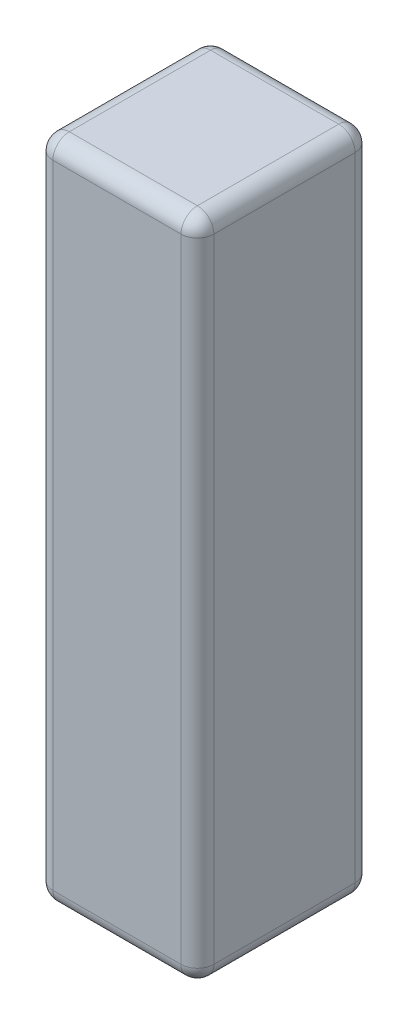
ISO-10303-21;
HEADER;
FILE_DESCRIPTION(('STEP AP214'),'2;1');
FILE_NAME('part.step','',(''),(''),'','','');
FILE_SCHEMA(('AUTOMOTIVE_DESIGN { 1 0 10303 214 1 1 1 1 }'));
ENDSEC;
DATA;
#1=APPLICATION_CONTEXT('core data for automotive mechanical design processes');
#2=APPLICATION_PROTOCOL_DEFINITION('international standard','automotive_design',2000,#1);
#3=PRODUCT_CONTEXT('',#1,'mechanical');
#4=PRODUCT('Part','Part','',(#3));
#5=PRODUCT_RELATED_PRODUCT_CATEGORY('part','',(#4));
#6=PRODUCT_DEFINITION_FORMATION('','',#4);
#7=PRODUCT_DEFINITION_CONTEXT('part definition',#1,'design');
#8=PRODUCT_DEFINITION('design','',#6,#7);
#9=PRODUCT_DEFINITION_SHAPE('','',#8);
#10=(LENGTH_UNIT() NAMED_UNIT(*) SI_UNIT(.MILLI.,.METRE.));
#11=(NAMED_UNIT(*) PLANE_ANGLE_UNIT() SI_UNIT($,.RADIAN.));
#12=(NAMED_UNIT(*) SI_UNIT($,.STERADIAN.) SOLID_ANGLE_UNIT());
#13=UNCERTAINTY_MEASURE_WITH_UNIT(LENGTH_MEASURE(1.E-05),#10,'distance_accuracy_value','');
#14=(GEOMETRIC_REPRESENTATION_CONTEXT(3) GLOBAL_UNCERTAINTY_ASSIGNED_CONTEXT((#13)) GLOBAL_UNIT_ASSIGNED_CONTEXT((#10,
#11,#12)) REPRESENTATION_CONTEXT('',''));
#15=CARTESIAN_POINT('',(0.,0.,0.));
#16=DIRECTION('',(0.,0.,1.));
#17=DIRECTION('',(1.,0.,0.));
#18=AXIS2_PLACEMENT_3D('',#15,#16,#17);
#19=CARTESIAN_POINT('',(-12.446,102.87,-13.462));
#20=DIRECTION('',(1.,0.,0.));
#21=DIRECTION('',(0.,0.,-1.));
#22=AXIS2_PLACEMENT_3D('',#19,#20,#21);
#23=PLANE('',#22);
#24=DIRECTION('',(0.,-1.,0.));
#25=VECTOR('',#24,1.);
#26=CARTESIAN_POINT('',(-12.446,102.87,-10.922));
#27=LINE('',#26,#25);
#28=CARTESIAN_POINT('',(-12.446,100.33,-10.922));
#29=VERTEX_POINT('',#28);
#30=CARTESIAN_POINT('',(-12.446,2.54,-10.922));
#31=VERTEX_POINT('',#30);
#32=EDGE_CURVE('E132',#29,#31,#27,.T.);
#33=ORIENTED_EDGE('',*,*,#32,.T.);
#34=DIRECTION('',(0.,0.,1.));
#35=VECTOR('',#34,1.);
#36=CARTESIAN_POINT('',(-12.446,2.54,13.462));
#37=LINE('',#36,#35);
#38=CARTESIAN_POINT('',(-12.446,2.54,10.922));
#39=VERTEX_POINT('',#38);
#40=EDGE_CURVE('E128',#31,#39,#37,.T.);
#41=ORIENTED_EDGE('',*,*,#40,.T.);
#42=DIRECTION('',(0.,-1.,0.));
#43=VECTOR('',#42,1.);
#44=CARTESIAN_POINT('',(-12.446,102.87,10.922));
#45=LINE('',#44,#43);
#46=CARTESIAN_POINT('',(-12.446,100.33,10.922));
#47=VERTEX_POINT('',#46);
#48=EDGE_CURVE('E121',#39,#47,#45,.F.);
#49=ORIENTED_EDGE('',*,*,#48,.T.);
#50=DIRECTION('',(0.,0.,1.));
#51=VECTOR('',#50,1.);
#52=CARTESIAN_POINT('',(-12.446,100.33,-13.462));
#53=LINE('',#52,#51);
#54=EDGE_CURVE('E125',#47,#29,#53,.F.);
#55=ORIENTED_EDGE('',*,*,#54,.T.);
#56=EDGE_LOOP('',(#33,#41,#49,#55));
#57=FACE_BOUND('',#56,.T.);
#58=ADVANCED_FACE('F33',(#57),#23,.F.);
#59=CARTESIAN_POINT('',(12.446,102.87,13.462));
#60=DIRECTION('',(0.,0.,-1.));
#61=DIRECTION('',(-1.,0.,0.));
#62=AXIS2_PLACEMENT_3D('',#59,#60,#61);
#63=PLANE('',#62);
#64=DIRECTION('',(0.,-1.,0.));
#65=VECTOR('',#64,1.);
#66=CARTESIAN_POINT('',(-9.906,102.87,13.462));
#67=LINE('',#66,#65);
#68=CARTESIAN_POINT('',(-9.906,100.33,13.462));
#69=VERTEX_POINT('',#68);
#70=CARTESIAN_POINT('',(-9.906,2.54,13.462));
#71=VERTEX_POINT('',#70);
#72=EDGE_CURVE('E140',#69,#71,#67,.T.);
#73=ORIENTED_EDGE('',*,*,#72,.T.);
#74=DIRECTION('',(1.,0.,0.));
#75=VECTOR('',#74,1.);
#76=CARTESIAN_POINT('',(12.446,2.54,13.462));
#77=LINE('',#76,#75);
#78=CARTESIAN_POINT('',(9.906,2.54,13.462));
#79=VERTEX_POINT('',#78);
#80=EDGE_CURVE('E187',#71,#79,#77,.T.);
#81=ORIENTED_EDGE('',*,*,#80,.T.);
#82=DIRECTION('',(0.,-1.,0.));
#83=VECTOR('',#82,1.);
#84=CARTESIAN_POINT('',(9.906,102.87,13.462));
#85=LINE('',#84,#83);
#86=CARTESIAN_POINT('',(9.906,100.33,13.462));
#87=VERTEX_POINT('',#86);
#88=EDGE_CURVE('E184',#79,#87,#85,.F.);
#89=ORIENTED_EDGE('',*,*,#88,.T.);
#90=DIRECTION('',(1.,0.,0.));
#91=VECTOR('',#90,1.);
#92=CARTESIAN_POINT('',(12.446,100.33,13.462));
#93=LINE('',#92,#91);
#94=EDGE_CURVE('E182',#87,#69,#93,.F.);
#95=ORIENTED_EDGE('',*,*,#94,.T.);
#96=EDGE_LOOP('',(#73,#81,#89,#95));
#97=FACE_BOUND('',#96,.T.);
#98=ADVANCED_FACE('F293',(#97),#63,.F.);
#99=CARTESIAN_POINT('',(12.446,102.87,-13.462));
#100=DIRECTION('',(-1.,0.,0.));
#101=DIRECTION('',(0.,0.,1.));
#102=AXIS2_PLACEMENT_3D('',#99,#100,#101);
#103=PLANE('',#102);
#104=DIRECTION('',(0.,-1.,0.));
#105=VECTOR('',#104,1.);
#106=CARTESIAN_POINT('',(12.446,102.87,10.922));
#107=LINE('',#106,#105);
#108=CARTESIAN_POINT('',(12.446,100.33,10.922));
#109=VERTEX_POINT('',#108);
#110=CARTESIAN_POINT('',(12.446,2.54,10.922));
#111=VERTEX_POINT('',#110);
#112=EDGE_CURVE('E175',#109,#111,#107,.T.);
#113=ORIENTED_EDGE('',*,*,#112,.T.);
#114=DIRECTION('',(0.,0.,-1.));
#115=VECTOR('',#114,1.);
#116=CARTESIAN_POINT('',(12.446,2.54,-13.462));
#117=LINE('',#116,#115);
#118=CARTESIAN_POINT('',(12.446,2.54,-10.922));
#119=VERTEX_POINT('',#118);
#120=EDGE_CURVE('E180',#111,#119,#117,.T.);
#121=ORIENTED_EDGE('',*,*,#120,.T.);
#122=DIRECTION('',(0.,-1.,0.));
#123=VECTOR('',#122,1.);
#124=CARTESIAN_POINT('',(12.446,102.87,-10.922));
#125=LINE('',#124,#123);
#126=CARTESIAN_POINT('',(12.446,100.33,-10.922));
#127=VERTEX_POINT('',#126);
#128=EDGE_CURVE('E177',#119,#127,#125,.F.);
#129=ORIENTED_EDGE('',*,*,#128,.T.);
#130=DIRECTION('',(0.,0.,-1.));
#131=VECTOR('',#130,1.);
#132=CARTESIAN_POINT('',(12.446,100.33,-13.462));
#133=LINE('',#132,#131);
#134=EDGE_CURVE('E173',#127,#109,#133,.F.);
#135=ORIENTED_EDGE('',*,*,#134,.T.);
#136=EDGE_LOOP('',(#113,#121,#129,#135));
#137=FACE_BOUND('',#136,.T.);
#138=ADVANCED_FACE('F272',(#137),#103,.F.);
#139=CARTESIAN_POINT('',(12.446,102.87,-13.462));
#140=DIRECTION('',(0.,0.,1.));
#141=DIRECTION('',(1.,0.,0.));
#142=AXIS2_PLACEMENT_3D('',#139,#140,#141);
#143=PLANE('',#142);
#144=DIRECTION('',(0.,-1.,0.));
#145=VECTOR('',#144,1.);
#146=CARTESIAN_POINT('',(9.906,102.87,-13.462));
#147=LINE('',#146,#145);
#148=CARTESIAN_POINT('',(9.906,100.33,-13.462));
#149=VERTEX_POINT('',#148);
#150=CARTESIAN_POINT('',(9.906,2.54,-13.462));
#151=VERTEX_POINT('',#150);
#152=EDGE_CURVE('E166',#149,#151,#147,.T.);
#153=ORIENTED_EDGE('',*,*,#152,.T.);
#154=DIRECTION('',(-1.,0.,0.));
#155=VECTOR('',#154,1.);
#156=CARTESIAN_POINT('',(-12.446,2.54,-13.462));
#157=LINE('',#156,#155);
#158=CARTESIAN_POINT('',(-9.906,2.54,-13.462));
#159=VERTEX_POINT('',#158);
#160=EDGE_CURVE('E171',#151,#159,#157,.T.);
#161=ORIENTED_EDGE('',*,*,#160,.T.);
#162=DIRECTION('',(0.,-1.,0.));
#163=VECTOR('',#162,1.);
#164=CARTESIAN_POINT('',(-9.906,102.87,-13.462));
#165=LINE('',#164,#163);
#166=CARTESIAN_POINT('',(-9.906,100.33,-13.462));
#167=VERTEX_POINT('',#166);
#168=EDGE_CURVE('E168',#159,#167,#165,.F.);
#169=ORIENTED_EDGE('',*,*,#168,.T.);
#170=DIRECTION('',(-1.,0.,0.));
#171=VECTOR('',#170,1.);
#172=CARTESIAN_POINT('',(12.446,100.33,-13.462));
#173=LINE('',#172,#171);
#174=EDGE_CURVE('E164',#167,#149,#173,.F.);
#175=ORIENTED_EDGE('',*,*,#174,.T.);
#176=EDGE_LOOP('',(#153,#161,#169,#175));
#177=FACE_BOUND('',#176,.T.);
#178=ADVANCED_FACE('F300',(#177),#143,.F.);
#179=CARTESIAN_POINT('',(0.,102.87,0.));
#180=DIRECTION('',(0.,-1.,0.));
#181=DIRECTION('',(0.,0.,-1.));
#182=AXIS2_PLACEMENT_3D('',#179,#180,#181);
#183=PLANE('',#182);
#184=DIRECTION('',(0.,0.,-1.));
#185=VECTOR('',#184,1.);
#186=CARTESIAN_POINT('',(9.906,102.87,0.));
#187=LINE('',#186,#185);
#188=CARTESIAN_POINT('',(9.906,102.87,10.922));
#189=VERTEX_POINT('',#188);
#190=CARTESIAN_POINT('',(9.906,102.87,-10.922));
#191=VERTEX_POINT('',#190);
#192=EDGE_CURVE('E42',#189,#191,#187,.T.);
#193=ORIENTED_EDGE('',*,*,#192,.T.);
#194=DIRECTION('',(-1.,0.,0.));
#195=VECTOR('',#194,1.);
#196=CARTESIAN_POINT('',(0.,102.87,-10.922));
#197=LINE('',#196,#195);
#198=CARTESIAN_POINT('',(-9.906,102.87,-10.922));
#199=VERTEX_POINT('',#198);
#200=EDGE_CURVE('E11',#191,#199,#197,.T.);
#201=ORIENTED_EDGE('',*,*,#200,.T.);
#202=DIRECTION('',(0.,0.,1.));
#203=VECTOR('',#202,1.);
#204=CARTESIAN_POINT('',(-9.906,102.87,0.));
#205=LINE('',#204,#203);
#206=CARTESIAN_POINT('',(-9.906,102.87,10.922));
#207=VERTEX_POINT('',#206);
#208=EDGE_CURVE('E198',#199,#207,#205,.T.);
#209=ORIENTED_EDGE('',*,*,#208,.T.);
#210=DIRECTION('',(1.,0.,0.));
#211=VECTOR('',#210,1.);
#212=CARTESIAN_POINT('',(0.,102.87,10.922));
#213=LINE('',#212,#211);
#214=EDGE_CURVE('E53',#207,#189,#213,.T.);
#215=ORIENTED_EDGE('',*,*,#214,.T.);
#216=EDGE_LOOP('',(#193,#201,#209,#215));
#217=FACE_BOUND('',#216,.T.);
#218=ADVANCED_FACE('F364',(#217),#183,.F.);
#219=CARTESIAN_POINT('',(0.,0.,0.));
#220=DIRECTION('',(0.,-1.,0.));
#221=DIRECTION('',(0.,0.,-1.));
#222=AXIS2_PLACEMENT_3D('',#219,#220,#221);
#223=PLANE('',#222);
#224=DIRECTION('',(0.,0.,-1.));
#225=VECTOR('',#224,1.);
#226=CARTESIAN_POINT('',(9.906,0.,13.462));
#227=LINE('',#226,#225);
#228=CARTESIAN_POINT('',(9.906,0.,-10.922));
#229=VERTEX_POINT('',#228);
#230=CARTESIAN_POINT('',(9.906,0.,10.922));
#231=VERTEX_POINT('',#230);
#232=EDGE_CURVE('E193',#229,#231,#227,.F.);
#233=ORIENTED_EDGE('',*,*,#232,.T.);
#234=DIRECTION('',(1.,0.,0.));
#235=VECTOR('',#234,1.);
#236=CARTESIAN_POINT('',(-12.446,0.,10.922));
#237=LINE('',#236,#235);
#238=CARTESIAN_POINT('',(-9.906,0.,10.922));
#239=VERTEX_POINT('',#238);
#240=EDGE_CURVE('E195',#231,#239,#237,.F.);
#241=ORIENTED_EDGE('',*,*,#240,.T.);
#242=DIRECTION('',(0.,0.,1.));
#243=VECTOR('',#242,1.);
#244=CARTESIAN_POINT('',(-9.906,0.,-13.462));
#245=LINE('',#244,#243);
#246=CARTESIAN_POINT('',(-9.906,0.,-10.922));
#247=VERTEX_POINT('',#246);
#248=EDGE_CURVE('E189',#239,#247,#245,.F.);
#249=ORIENTED_EDGE('',*,*,#248,.T.);
#250=DIRECTION('',(-1.,0.,0.));
#251=VECTOR('',#250,1.);
#252=CARTESIAN_POINT('',(12.446,0.,-10.922));
#253=LINE('',#252,#251);
#254=EDGE_CURVE('E191',#247,#229,#253,.F.);
#255=ORIENTED_EDGE('',*,*,#254,.T.);
#256=EDGE_LOOP('',(#233,#241,#249,#255));
#257=FACE_BOUND('',#256,.T.);
#258=ADVANCED_FACE('F264',(#257),#223,.T.);
#259=CARTESIAN_POINT('',(9.906,102.87,10.922));
#260=DIRECTION('',(0.,-1.,0.));
#261=DIRECTION('',(0.,0.,-1.));
#262=AXIS2_PLACEMENT_3D('',#259,#260,#261);
#263=CYLINDRICAL_SURFACE('',#262,2.54);
#264=CARTESIAN_POINT('',(9.906,100.33,10.922));
#265=DIRECTION('',(0.,1.,0.));
#266=DIRECTION('',(0.,0.,1.));
#267=AXIS2_PLACEMENT_3D('',#264,#265,#266);
#268=CIRCLE('',#267,2.54);
#269=EDGE_CURVE('E37',#87,#109,#268,.T.);
#270=ORIENTED_EDGE('',*,*,#269,.F.);
#271=ORIENTED_EDGE('',*,*,#88,.F.);
#272=CARTESIAN_POINT('',(9.906,2.54,10.922));
#273=DIRECTION('',(0.,-1.,0.));
#274=DIRECTION('',(0.,0.,-1.));
#275=AXIS2_PLACEMENT_3D('',#272,#273,#274);
#276=CIRCLE('',#275,2.54);
#277=EDGE_CURVE('E160',#111,#79,#276,.T.);
#278=ORIENTED_EDGE('',*,*,#277,.F.);
#279=ORIENTED_EDGE('',*,*,#112,.F.);
#280=EDGE_LOOP('',(#270,#271,#278,#279));
#281=FACE_BOUND('',#280,.T.);
#282=ADVANCED_FACE('F35',(#281),#263,.T.);
#283=CARTESIAN_POINT('',(9.906,100.33,10.922));
#284=DIRECTION('',(1.,0.,0.));
#285=DIRECTION('',(0.,0.,-1.));
#286=AXIS2_PLACEMENT_3D('',#283,#284,#285);
#287=SPHERICAL_SURFACE('',#286,2.54);
#288=CARTESIAN_POINT('',(9.906,100.33,10.922));
#289=DIRECTION('',(1.,0.,0.));
#290=DIRECTION('',(0.,0.,-1.));
#291=AXIS2_PLACEMENT_3D('',#288,#289,#290);
#292=CIRCLE('',#291,2.54);
#293=EDGE_CURVE('E244',#87,#189,#292,.F.);
#294=ORIENTED_EDGE('',*,*,#293,.F.);
#295=ORIENTED_EDGE('',*,*,#269,.T.);
#296=CARTESIAN_POINT('',(9.906,100.33,10.922));
#297=DIRECTION('',(0.,0.,1.));
#298=DIRECTION('',(1.,0.,0.));
#299=AXIS2_PLACEMENT_3D('',#296,#297,#298);
#300=CIRCLE('',#299,2.54);
#301=EDGE_CURVE('E246',#189,#109,#300,.F.);
#302=ORIENTED_EDGE('',*,*,#301,.F.);
#303=EDGE_LOOP('',(#294,#295,#302));
#304=FACE_BOUND('',#303,.T.);
#305=ADVANCED_FACE('F288',(#304),#287,.T.);
#306=CARTESIAN_POINT('',(9.906,2.54,10.922));
#307=DIRECTION('',(0.,0.,1.));
#308=DIRECTION('',(0.,-1.,0.));
#309=AXIS2_PLACEMENT_3D('',#306,#307,#308);
#310=SPHERICAL_SURFACE('',#309,2.54);
#311=CARTESIAN_POINT('',(9.906,2.54,10.922));
#312=DIRECTION('',(0.,0.,1.));
#313=DIRECTION('',(1.,0.,0.));
#314=AXIS2_PLACEMENT_3D('',#311,#312,#313);
#315=CIRCLE('',#314,2.54);
#316=EDGE_CURVE('E238',#111,#231,#315,.F.);
#317=ORIENTED_EDGE('',*,*,#316,.F.);
#318=ORIENTED_EDGE('',*,*,#277,.T.);
#319=CARTESIAN_POINT('',(9.906,2.54,10.922));
#320=DIRECTION('',(1.,0.,0.));
#321=DIRECTION('',(0.,0.,-1.));
#322=AXIS2_PLACEMENT_3D('',#319,#320,#321);
#323=CIRCLE('',#322,2.54);
#324=EDGE_CURVE('E241',#231,#79,#323,.F.);
#325=ORIENTED_EDGE('',*,*,#324,.F.);
#326=EDGE_LOOP('',(#317,#318,#325));
#327=FACE_BOUND('',#326,.T.);
#328=ADVANCED_FACE('F253',(#327),#310,.T.);
#329=CARTESIAN_POINT('',(9.906,100.33,0.));
#330=DIRECTION('',(0.,0.,-1.));
#331=DIRECTION('',(-1.,0.,0.));
#332=AXIS2_PLACEMENT_3D('',#329,#330,#331);
#333=CYLINDRICAL_SURFACE('',#332,2.54);
#334=ORIENTED_EDGE('',*,*,#301,.T.);
#335=ORIENTED_EDGE('',*,*,#134,.F.);
#336=CARTESIAN_POINT('',(9.906,100.33,-10.922));
#337=DIRECTION('',(0.,0.,-1.));
#338=DIRECTION('',(-1.,0.,0.));
#339=AXIS2_PLACEMENT_3D('',#336,#337,#338);
#340=CIRCLE('',#339,2.54);
#341=EDGE_CURVE('E233',#191,#127,#340,.T.);
#342=ORIENTED_EDGE('',*,*,#341,.F.);
#343=ORIENTED_EDGE('',*,*,#192,.F.);
#344=EDGE_LOOP('',(#334,#335,#342,#343));
#345=FACE_BOUND('',#344,.T.);
#346=ADVANCED_FACE('F283',(#345),#333,.T.);
#347=CARTESIAN_POINT('',(0.,100.33,10.922));
#348=DIRECTION('',(1.,0.,0.));
#349=DIRECTION('',(0.,0.,-1.));
#350=AXIS2_PLACEMENT_3D('',#347,#348,#349);
#351=CYLINDRICAL_SURFACE('',#350,2.54);
#352=ORIENTED_EDGE('',*,*,#293,.T.);
#353=ORIENTED_EDGE('',*,*,#214,.F.);
#354=CARTESIAN_POINT('',(-9.906,100.33,10.922));
#355=DIRECTION('',(-1.,0.,0.));
#356=DIRECTION('',(0.,0.,1.));
#357=AXIS2_PLACEMENT_3D('',#354,#355,#356);
#358=CIRCLE('',#357,2.54);
#359=EDGE_CURVE('E144',#69,#207,#358,.T.);
#360=ORIENTED_EDGE('',*,*,#359,.F.);
#361=ORIENTED_EDGE('',*,*,#94,.F.);
#362=EDGE_LOOP('',(#352,#353,#360,#361));
#363=FACE_BOUND('',#362,.T.);
#364=ADVANCED_FACE('F291',(#363),#351,.T.);
#365=CARTESIAN_POINT('',(-9.906,102.87,10.922));
#366=DIRECTION('',(0.,-1.,0.));
#367=DIRECTION('',(0.,0.,-1.));
#368=AXIS2_PLACEMENT_3D('',#365,#366,#367);
#369=CYLINDRICAL_SURFACE('',#368,2.54);
#370=CARTESIAN_POINT('',(-9.906,2.54,10.922));
#371=DIRECTION('',(0.,-1.,0.));
#372=DIRECTION('',(0.,0.,-1.));
#373=AXIS2_PLACEMENT_3D('',#370,#371,#372);
#374=CIRCLE('',#373,2.54);
#375=EDGE_CURVE('E145',#71,#39,#374,.T.);
#376=ORIENTED_EDGE('',*,*,#375,.F.);
#377=ORIENTED_EDGE('',*,*,#72,.F.);
#378=CARTESIAN_POINT('',(-9.906,100.33,10.922));
#379=DIRECTION('',(0.,1.,0.));
#380=DIRECTION('',(0.,0.,1.));
#381=AXIS2_PLACEMENT_3D('',#378,#379,#380);
#382=CIRCLE('',#381,2.54);
#383=EDGE_CURVE('E136',#47,#69,#382,.T.);
#384=ORIENTED_EDGE('',*,*,#383,.F.);
#385=ORIENTED_EDGE('',*,*,#48,.F.);
#386=EDGE_LOOP('',(#376,#377,#384,#385));
#387=FACE_BOUND('',#386,.T.);
#388=ADVANCED_FACE('F138',(#387),#369,.T.);
#389=CARTESIAN_POINT('',(12.446,2.54,10.922));
#390=DIRECTION('',(-1.,0.,0.));
#391=DIRECTION('',(0.,0.,1.));
#392=AXIS2_PLACEMENT_3D('',#389,#390,#391);
#393=CYLINDRICAL_SURFACE('',#392,2.54);
#394=ORIENTED_EDGE('',*,*,#324,.T.);
#395=ORIENTED_EDGE('',*,*,#80,.F.);
#396=CARTESIAN_POINT('',(-9.906,2.54,10.922));
#397=DIRECTION('',(-1.,0.,0.));
#398=DIRECTION('',(0.,0.,1.));
#399=AXIS2_PLACEMENT_3D('',#396,#397,#398);
#400=CIRCLE('',#399,2.54);
#401=EDGE_CURVE('E229',#239,#71,#400,.T.);
#402=ORIENTED_EDGE('',*,*,#401,.F.);
#403=ORIENTED_EDGE('',*,*,#240,.F.);
#404=EDGE_LOOP('',(#394,#395,#402,#403));
#405=FACE_BOUND('',#404,.T.);
#406=ADVANCED_FACE('F261',(#405),#393,.T.);
#407=CARTESIAN_POINT('',(9.906,2.54,-13.462));
#408=DIRECTION('',(0.,0.,1.));
#409=DIRECTION('',(1.,0.,0.));
#410=AXIS2_PLACEMENT_3D('',#407,#408,#409);
#411=CYLINDRICAL_SURFACE('',#410,2.54);
#412=ORIENTED_EDGE('',*,*,#316,.T.);
#413=ORIENTED_EDGE('',*,*,#232,.F.);
#414=CARTESIAN_POINT('',(9.906,2.54,-10.922));
#415=DIRECTION('',(0.,0.,-1.));
#416=DIRECTION('',(-1.,0.,0.));
#417=AXIS2_PLACEMENT_3D('',#414,#415,#416);
#418=CIRCLE('',#417,2.54);
#419=EDGE_CURVE('E226',#119,#229,#418,.T.);
#420=ORIENTED_EDGE('',*,*,#419,.F.);
#421=ORIENTED_EDGE('',*,*,#120,.F.);
#422=EDGE_LOOP('',(#412,#413,#420,#421));
#423=FACE_BOUND('',#422,.T.);
#424=ADVANCED_FACE('F269',(#423),#411,.T.);
#425=CARTESIAN_POINT('',(9.906,102.87,-10.922));
#426=DIRECTION('',(0.,-1.,0.));
#427=DIRECTION('',(0.,0.,-1.));
#428=AXIS2_PLACEMENT_3D('',#425,#426,#427);
#429=CYLINDRICAL_SURFACE('',#428,2.54);
#430=CARTESIAN_POINT('',(9.906,100.33,-10.922));
#431=DIRECTION('',(0.,1.,0.));
#432=DIRECTION('',(0.,0.,1.));
#433=AXIS2_PLACEMENT_3D('',#430,#431,#432);
#434=CIRCLE('',#433,2.54);
#435=EDGE_CURVE('E235',#127,#149,#434,.T.);
#436=ORIENTED_EDGE('',*,*,#435,.F.);
#437=ORIENTED_EDGE('',*,*,#128,.F.);
#438=CARTESIAN_POINT('',(9.906,2.54,-10.922));
#439=DIRECTION('',(0.,-1.,0.));
#440=DIRECTION('',(0.,0.,-1.));
#441=AXIS2_PLACEMENT_3D('',#438,#439,#440);
#442=CIRCLE('',#441,2.54);
#443=EDGE_CURVE('E223',#151,#119,#442,.T.);
#444=ORIENTED_EDGE('',*,*,#443,.F.);
#445=ORIENTED_EDGE('',*,*,#152,.F.);
#446=EDGE_LOOP('',(#436,#437,#444,#445));
#447=FACE_BOUND('',#446,.T.);
#448=ADVANCED_FACE('F276',(#447),#429,.T.);
#449=CARTESIAN_POINT('',(9.906,100.33,-10.922));
#450=DIRECTION('',(1.,0.,0.));
#451=DIRECTION('',(0.,0.,-1.));
#452=AXIS2_PLACEMENT_3D('',#449,#450,#451);
#453=SPHERICAL_SURFACE('',#452,2.54);
#454=ORIENTED_EDGE('',*,*,#341,.T.);
#455=ORIENTED_EDGE('',*,*,#435,.T.);
#456=CARTESIAN_POINT('',(9.906,100.33,-10.922));
#457=DIRECTION('',(1.,0.,0.));
#458=DIRECTION('',(0.,0.,-1.));
#459=AXIS2_PLACEMENT_3D('',#456,#457,#458);
#460=CIRCLE('',#459,2.54);
#461=EDGE_CURVE('E152',#191,#149,#460,.F.);
#462=ORIENTED_EDGE('',*,*,#461,.F.);
#463=EDGE_LOOP('',(#454,#455,#462));
#464=FACE_BOUND('',#463,.T.);
#465=ADVANCED_FACE('F341',(#464),#453,.T.);
#466=CARTESIAN_POINT('',(-9.906,100.33,10.922));
#467=DIRECTION('',(0.,0.,1.));
#468=DIRECTION('',(1.,0.,0.));
#469=AXIS2_PLACEMENT_3D('',#466,#467,#468);
#470=SPHERICAL_SURFACE('',#469,2.54);
#471=ORIENTED_EDGE('',*,*,#383,.T.);
#472=ORIENTED_EDGE('',*,*,#359,.T.);
#473=CARTESIAN_POINT('',(-9.906,100.33,10.922));
#474=DIRECTION('',(0.,0.,1.));
#475=DIRECTION('',(1.,0.,0.));
#476=AXIS2_PLACEMENT_3D('',#473,#474,#475);
#477=CIRCLE('',#476,2.54);
#478=EDGE_CURVE('E148',#47,#207,#477,.F.);
#479=ORIENTED_EDGE('',*,*,#478,.F.);
#480=EDGE_LOOP('',(#471,#472,#479));
#481=FACE_BOUND('',#480,.T.);
#482=ADVANCED_FACE('F149',(#481),#470,.T.);
#483=CARTESIAN_POINT('',(-9.906,2.54,10.922));
#484=DIRECTION('',(0.,0.,1.));
#485=DIRECTION('',(0.,-1.,0.));
#486=AXIS2_PLACEMENT_3D('',#483,#484,#485);
#487=SPHERICAL_SURFACE('',#486,2.54);
#488=ORIENTED_EDGE('',*,*,#401,.T.);
#489=ORIENTED_EDGE('',*,*,#375,.T.);
#490=CARTESIAN_POINT('',(-9.906,2.54,10.922));
#491=DIRECTION('',(0.,0.,1.));
#492=DIRECTION('',(1.,0.,0.));
#493=AXIS2_PLACEMENT_3D('',#490,#491,#492);
#494=CIRCLE('',#493,2.54);
#495=EDGE_CURVE('E153',#239,#39,#494,.F.);
#496=ORIENTED_EDGE('',*,*,#495,.F.);
#497=EDGE_LOOP('',(#488,#489,#496));
#498=FACE_BOUND('',#497,.T.);
#499=ADVANCED_FACE('F334',(#498),#487,.T.);
#500=CARTESIAN_POINT('',(9.906,2.54,-10.922));
#501=DIRECTION('',(1.,0.,0.));
#502=DIRECTION('',(0.,1.,0.));
#503=AXIS2_PLACEMENT_3D('',#500,#501,#502);
#504=SPHERICAL_SURFACE('',#503,2.54);
#505=ORIENTED_EDGE('',*,*,#443,.T.);
#506=ORIENTED_EDGE('',*,*,#419,.T.);
#507=CARTESIAN_POINT('',(9.906,2.54,-10.922));
#508=DIRECTION('',(1.,0.,0.));
#509=DIRECTION('',(0.,0.,-1.));
#510=AXIS2_PLACEMENT_3D('',#507,#508,#509);
#511=CIRCLE('',#510,2.54);
#512=EDGE_CURVE('E216',#151,#229,#511,.F.);
#513=ORIENTED_EDGE('',*,*,#512,.F.);
#514=EDGE_LOOP('',(#505,#506,#513));
#515=FACE_BOUND('',#514,.T.);
#516=ADVANCED_FACE('F330',(#515),#504,.T.);
#517=CARTESIAN_POINT('',(0.,100.33,-10.922));
#518=DIRECTION('',(-1.,0.,0.));
#519=DIRECTION('',(0.,0.,1.));
#520=AXIS2_PLACEMENT_3D('',#517,#518,#519);
#521=CYLINDRICAL_SURFACE('',#520,2.54);
#522=ORIENTED_EDGE('',*,*,#461,.T.);
#523=ORIENTED_EDGE('',*,*,#174,.F.);
#524=CARTESIAN_POINT('',(-9.906,100.33,-10.922));
#525=DIRECTION('',(-1.,0.,0.));
#526=DIRECTION('',(0.,0.,1.));
#527=AXIS2_PLACEMENT_3D('',#524,#525,#526);
#528=CIRCLE('',#527,2.54);
#529=EDGE_CURVE('E213',#199,#167,#528,.T.);
#530=ORIENTED_EDGE('',*,*,#529,.F.);
#531=ORIENTED_EDGE('',*,*,#200,.F.);
#532=EDGE_LOOP('',(#522,#523,#530,#531));
#533=FACE_BOUND('',#532,.T.);
#534=ADVANCED_FACE('F327',(#533),#521,.T.);
#535=CARTESIAN_POINT('',(-9.906,100.33,0.));
#536=DIRECTION('',(0.,0.,1.));
#537=DIRECTION('',(1.,0.,0.));
#538=AXIS2_PLACEMENT_3D('',#535,#536,#537);
#539=CYLINDRICAL_SURFACE('',#538,2.54);
#540=ORIENTED_EDGE('',*,*,#478,.T.);
#541=ORIENTED_EDGE('',*,*,#208,.F.);
#542=CARTESIAN_POINT('',(-9.906,100.33,-10.922));
#543=DIRECTION('',(0.,0.,-1.));
#544=DIRECTION('',(-1.,0.,0.));
#545=AXIS2_PLACEMENT_3D('',#542,#543,#544);
#546=CIRCLE('',#545,2.54);
#547=EDGE_CURVE('E156',#29,#199,#546,.T.);
#548=ORIENTED_EDGE('',*,*,#547,.F.);
#549=ORIENTED_EDGE('',*,*,#54,.F.);
#550=EDGE_LOOP('',(#540,#541,#548,#549));
#551=FACE_BOUND('',#550,.T.);
#552=ADVANCED_FACE('F155',(#551),#539,.T.);
#553=CARTESIAN_POINT('',(-9.906,2.54,-13.462));
#554=DIRECTION('',(0.,0.,-1.));
#555=DIRECTION('',(-1.,0.,0.));
#556=AXIS2_PLACEMENT_3D('',#553,#554,#555);
#557=CYLINDRICAL_SURFACE('',#556,2.54);
#558=ORIENTED_EDGE('',*,*,#495,.T.);
#559=ORIENTED_EDGE('',*,*,#40,.F.);
#560=CARTESIAN_POINT('',(-9.906,2.54,-10.922));
#561=DIRECTION('',(0.,0.,-1.));
#562=DIRECTION('',(-1.,0.,0.));
#563=AXIS2_PLACEMENT_3D('',#560,#561,#562);
#564=CIRCLE('',#563,2.54);
#565=EDGE_CURVE('E209',#247,#31,#564,.T.);
#566=ORIENTED_EDGE('',*,*,#565,.F.);
#567=ORIENTED_EDGE('',*,*,#248,.F.);
#568=EDGE_LOOP('',(#558,#559,#566,#567));
#569=FACE_BOUND('',#568,.T.);
#570=ADVANCED_FACE('F320',(#569),#557,.T.);
#571=CARTESIAN_POINT('',(12.446,2.54,-10.922));
#572=DIRECTION('',(1.,0.,0.));
#573=DIRECTION('',(0.,0.,-1.));
#574=AXIS2_PLACEMENT_3D('',#571,#572,#573);
#575=CYLINDRICAL_SURFACE('',#574,2.54);
#576=ORIENTED_EDGE('',*,*,#512,.T.);
#577=ORIENTED_EDGE('',*,*,#254,.F.);
#578=CARTESIAN_POINT('',(-9.906,2.54,-10.922));
#579=DIRECTION('',(-1.,0.,0.));
#580=DIRECTION('',(0.,0.,1.));
#581=AXIS2_PLACEMENT_3D('',#578,#579,#580);
#582=CIRCLE('',#581,2.54);
#583=EDGE_CURVE('E206',#159,#247,#582,.T.);
#584=ORIENTED_EDGE('',*,*,#583,.F.);
#585=ORIENTED_EDGE('',*,*,#160,.F.);
#586=EDGE_LOOP('',(#576,#577,#584,#585));
#587=FACE_BOUND('',#586,.T.);
#588=ADVANCED_FACE('F316',(#587),#575,.T.);
#589=CARTESIAN_POINT('',(-9.906,100.33,-10.922));
#590=DIRECTION('',(0.,1.,0.));
#591=DIRECTION('',(0.,0.,1.));
#592=AXIS2_PLACEMENT_3D('',#589,#590,#591);
#593=SPHERICAL_SURFACE('',#592,2.54);
#594=ORIENTED_EDGE('',*,*,#547,.T.);
#595=ORIENTED_EDGE('',*,*,#529,.T.);
#596=CARTESIAN_POINT('',(-9.906,100.33,-10.922));
#597=DIRECTION('',(0.,1.,0.));
#598=DIRECTION('',(0.,0.,1.));
#599=AXIS2_PLACEMENT_3D('',#596,#597,#598);
#600=CIRCLE('',#599,2.54);
#601=EDGE_CURVE('E204',#29,#167,#600,.F.);
#602=ORIENTED_EDGE('',*,*,#601,.F.);
#603=EDGE_LOOP('',(#594,#595,#602));
#604=FACE_BOUND('',#603,.T.);
#605=ADVANCED_FACE('F312',(#604),#593,.T.);
#606=CARTESIAN_POINT('',(-9.906,2.54,-10.922));
#607=DIRECTION('',(0.,-1.,0.));
#608=DIRECTION('',(0.,0.,-1.));
#609=AXIS2_PLACEMENT_3D('',#606,#607,#608);
#610=SPHERICAL_SURFACE('',#609,2.54);
#611=ORIENTED_EDGE('',*,*,#583,.T.);
#612=ORIENTED_EDGE('',*,*,#565,.T.);
#613=CARTESIAN_POINT('',(-9.906,2.54,-10.922));
#614=DIRECTION('',(0.,-1.,0.));
#615=DIRECTION('',(0.,0.,-1.));
#616=AXIS2_PLACEMENT_3D('',#613,#614,#615);
#617=CIRCLE('',#616,2.54);
#618=EDGE_CURVE('E202',#159,#31,#617,.F.);
#619=ORIENTED_EDGE('',*,*,#618,.F.);
#620=EDGE_LOOP('',(#611,#612,#619));
#621=FACE_BOUND('',#620,.T.);
#622=ADVANCED_FACE('F308',(#621),#610,.T.);
#623=CARTESIAN_POINT('',(-9.906,102.87,-10.922));
#624=DIRECTION('',(0.,-1.,0.));
#625=DIRECTION('',(0.,0.,-1.));
#626=AXIS2_PLACEMENT_3D('',#623,#624,#625);
#627=CYLINDRICAL_SURFACE('',#626,2.54);
#628=ORIENTED_EDGE('',*,*,#601,.T.);
#629=ORIENTED_EDGE('',*,*,#168,.F.);
#630=ORIENTED_EDGE('',*,*,#618,.T.);
#631=ORIENTED_EDGE('',*,*,#32,.F.);
#632=EDGE_LOOP('',(#628,#629,#630,#631));
#633=FACE_BOUND('',#632,.T.);
#634=ADVANCED_FACE('F305',(#633),#627,.T.);
#635=CLOSED_SHELL('',(#58,#98,#138,#178,#218,#258,#282,#305,#328,#346,#364,#388,#406,#424,#448,
#465,#482,#499,#516,#534,#552,#570,#588,#605,#622,#634));
#636=MANIFOLD_SOLID_BREP('B2',#635);
#637=ADVANCED_BREP_SHAPE_REPRESENTATION('',(#18,#636),#14);
#638=SHAPE_DEFINITION_REPRESENTATION(#9,#637);
ENDSEC;
END-ISO-10303-21;
